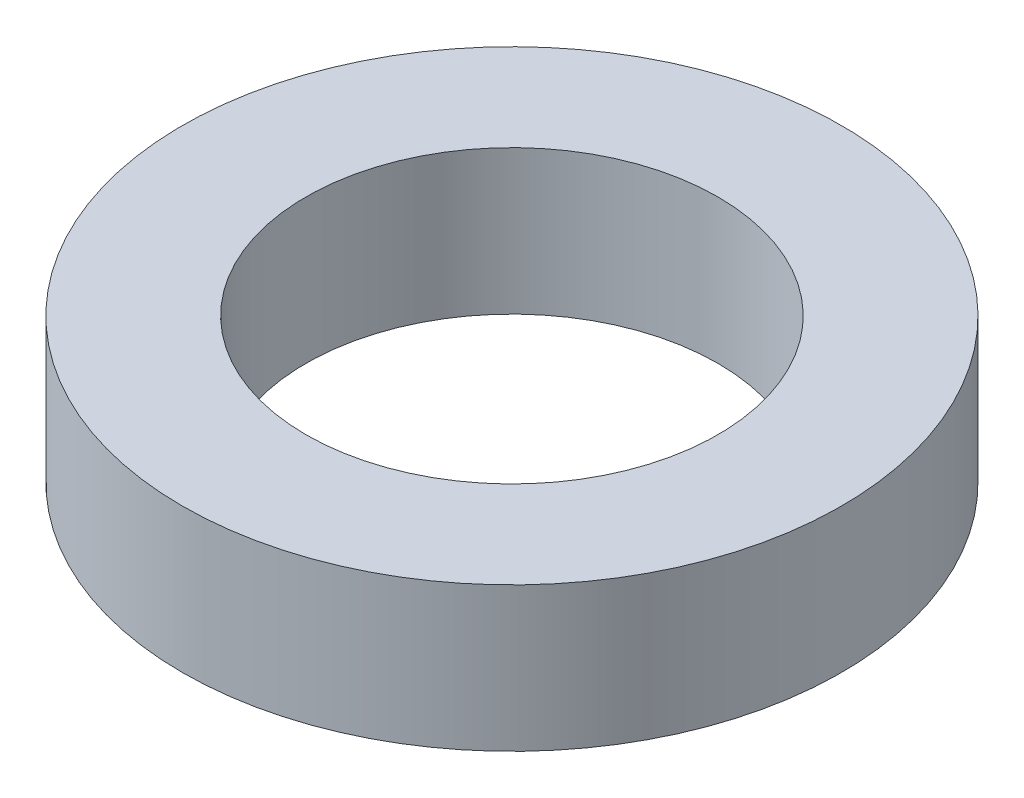
ISO-10303-21;
HEADER;
FILE_DESCRIPTION(('STEP AP214'),'2;1');
FILE_NAME('part.step','',(''),(''),'','','');
FILE_SCHEMA(('AUTOMOTIVE_DESIGN { 1 0 10303 214 1 1 1 1 }'));
ENDSEC;
DATA;
#1=APPLICATION_CONTEXT('core data for automotive mechanical design processes');
#2=APPLICATION_PROTOCOL_DEFINITION('international standard','automotive_design',2000,#1);
#3=PRODUCT_CONTEXT('',#1,'mechanical');
#4=PRODUCT('Part','Part','',(#3));
#5=PRODUCT_RELATED_PRODUCT_CATEGORY('part','',(#4));
#6=PRODUCT_DEFINITION_FORMATION('','',#4);
#7=PRODUCT_DEFINITION_CONTEXT('part definition',#1,'design');
#8=PRODUCT_DEFINITION('design','',#6,#7);
#9=PRODUCT_DEFINITION_SHAPE('','',#8);
#10=(LENGTH_UNIT() NAMED_UNIT(*) SI_UNIT(.MILLI.,.METRE.));
#11=(NAMED_UNIT(*) PLANE_ANGLE_UNIT() SI_UNIT($,.RADIAN.));
#12=(NAMED_UNIT(*) SI_UNIT($,.STERADIAN.) SOLID_ANGLE_UNIT());
#13=UNCERTAINTY_MEASURE_WITH_UNIT(LENGTH_MEASURE(1.E-05),#10,'distance_accuracy_value','');
#14=(GEOMETRIC_REPRESENTATION_CONTEXT(3) GLOBAL_UNCERTAINTY_ASSIGNED_CONTEXT((#13)) GLOBAL_UNIT_ASSIGNED_CONTEXT((#10,
#11,#12)) REPRESENTATION_CONTEXT('',''));
#15=CARTESIAN_POINT('',(0.,0.,0.));
#16=DIRECTION('',(0.,0.,1.));
#17=DIRECTION('',(1.,0.,0.));
#18=AXIS2_PLACEMENT_3D('',#15,#16,#17);
#19=CARTESIAN_POINT('',(0.,7.,0.));
#20=DIRECTION('',(0.,1.,0.));
#21=DIRECTION('',(0.,0.,1.));
#22=AXIS2_PLACEMENT_3D('',#19,#20,#21);
#23=PLANE('',#22);
#24=CARTESIAN_POINT('',(0.,7.,0.));
#25=DIRECTION('',(0.,1.,0.));
#26=DIRECTION('',(0.,0.,1.));
#27=AXIS2_PLACEMENT_3D('',#24,#25,#26);
#28=CIRCLE('',#27,16.);
#29=CARTESIAN_POINT('',(0.,7.,16.));
#30=VERTEX_POINT('',#29);
#31=EDGE_CURVE('E10',#30,#30,#28,.T.);
#32=ORIENTED_EDGE('',*,*,#31,.T.);
#33=EDGE_LOOP('',(#32));
#34=FACE_BOUND('',#33,.T.);
#35=CARTESIAN_POINT('',(0.,7.,0.));
#36=DIRECTION('',(0.,1.,0.));
#37=DIRECTION('',(0.,0.,1.));
#38=AXIS2_PLACEMENT_3D('',#35,#36,#37);
#39=CIRCLE('',#38,10.);
#40=CARTESIAN_POINT('',(0.,7.,10.));
#41=VERTEX_POINT('',#40);
#42=EDGE_CURVE('E50',#41,#41,#39,.T.);
#43=ORIENTED_EDGE('',*,*,#42,.F.);
#44=EDGE_LOOP('',(#43));
#45=FACE_BOUND('',#44,.T.);
#46=ADVANCED_FACE('F39',(#34,#45),#23,.T.);
#47=CARTESIAN_POINT('',(0.,0.,0.));
#48=DIRECTION('',(0.,1.,0.));
#49=DIRECTION('',(0.,0.,1.));
#50=AXIS2_PLACEMENT_3D('',#47,#48,#49);
#51=PLANE('',#50);
#52=CARTESIAN_POINT('',(0.,0.,0.));
#53=DIRECTION('',(0.,1.,0.));
#54=DIRECTION('',(0.,0.,1.));
#55=AXIS2_PLACEMENT_3D('',#52,#53,#54);
#56=CIRCLE('',#55,16.);
#57=CARTESIAN_POINT('',(0.,0.,16.));
#58=VERTEX_POINT('',#57);
#59=EDGE_CURVE('E43',#58,#58,#56,.T.);
#60=ORIENTED_EDGE('',*,*,#59,.F.);
#61=EDGE_LOOP('',(#60));
#62=FACE_BOUND('',#61,.T.);
#63=CARTESIAN_POINT('',(0.,0.,0.));
#64=DIRECTION('',(0.,1.,0.));
#65=DIRECTION('',(0.,0.,1.));
#66=AXIS2_PLACEMENT_3D('',#63,#64,#65);
#67=CIRCLE('',#66,10.);
#68=CARTESIAN_POINT('',(0.,0.,10.));
#69=VERTEX_POINT('',#68);
#70=EDGE_CURVE('E52',#69,#69,#67,.T.);
#71=ORIENTED_EDGE('',*,*,#70,.T.);
#72=EDGE_LOOP('',(#71));
#73=FACE_BOUND('',#72,.T.);
#74=ADVANCED_FACE('F62',(#62,#73),#51,.F.);
#75=CARTESIAN_POINT('',(0.,7.,0.));
#76=DIRECTION('',(0.,-1.,0.));
#77=DIRECTION('',(0.,0.,-1.));
#78=AXIS2_PLACEMENT_3D('',#75,#76,#77);
#79=CYLINDRICAL_SURFACE('',#78,16.);
#80=ORIENTED_EDGE('',*,*,#31,.F.);
#81=EDGE_LOOP('',(#80));
#82=FACE_BOUND('',#81,.T.);
#83=ORIENTED_EDGE('',*,*,#59,.T.);
#84=EDGE_LOOP('',(#83));
#85=FACE_BOUND('',#84,.T.);
#86=ADVANCED_FACE('F41',(#82,#85),#79,.T.);
#87=CARTESIAN_POINT('',(0.,7.,0.));
#88=DIRECTION('',(0.,-1.,0.));
#89=DIRECTION('',(0.,0.,-1.));
#90=AXIS2_PLACEMENT_3D('',#87,#88,#89);
#91=CYLINDRICAL_SURFACE('',#90,10.);
#92=ORIENTED_EDGE('',*,*,#42,.T.);
#93=EDGE_LOOP('',(#92));
#94=FACE_BOUND('',#93,.T.);
#95=ORIENTED_EDGE('',*,*,#70,.F.);
#96=EDGE_LOOP('',(#95));
#97=FACE_BOUND('',#96,.T.);
#98=ADVANCED_FACE('F58',(#94,#97),#91,.F.);
#99=CLOSED_SHELL('',(#46,#74,#86,#98));
#100=MANIFOLD_SOLID_BREP('B2',#99);
#101=ADVANCED_BREP_SHAPE_REPRESENTATION('',(#18,#100),#14);
#102=SHAPE_DEFINITION_REPRESENTATION(#9,#101);
ENDSEC;
END-ISO-10303-21;
